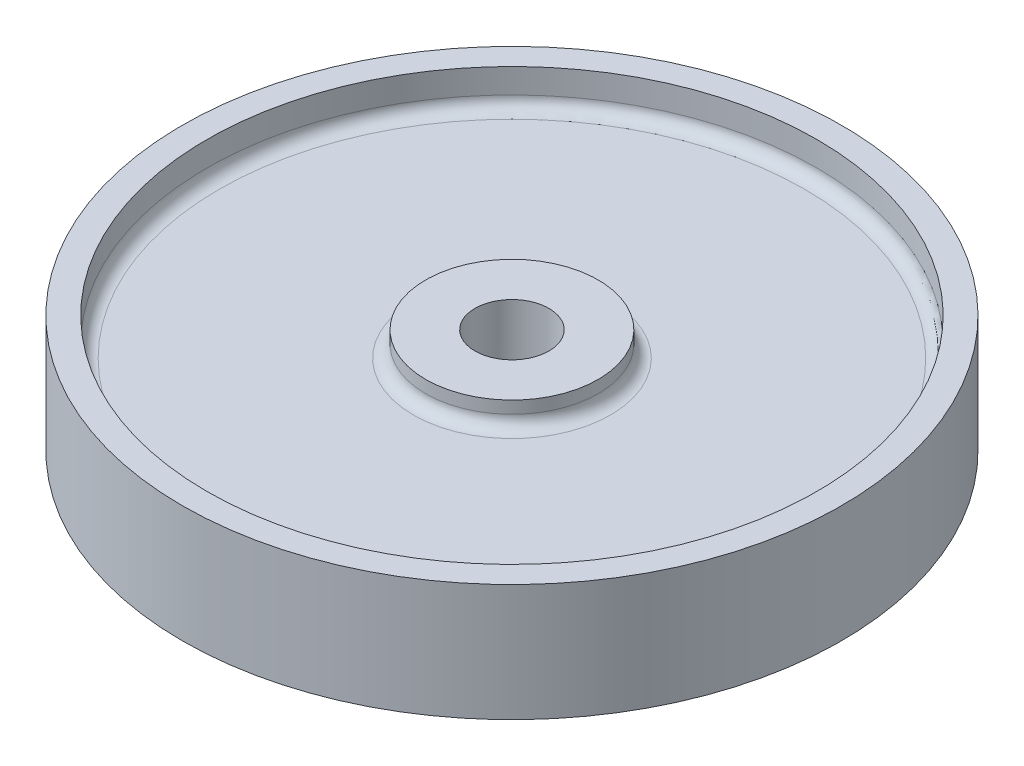
ISO-10303-21;
HEADER;
FILE_DESCRIPTION(('STEP AP214'),'2;1');
FILE_NAME('part.step','',(''),(''),'','','');
FILE_SCHEMA(('AUTOMOTIVE_DESIGN { 1 0 10303 214 1 1 1 1 }'));
ENDSEC;
DATA;
#1=APPLICATION_CONTEXT('core data for automotive mechanical design processes');
#2=APPLICATION_PROTOCOL_DEFINITION('international standard','automotive_design',2000,#1);
#3=PRODUCT_CONTEXT('',#1,'mechanical');
#4=PRODUCT('Part','Part','',(#3));
#5=PRODUCT_RELATED_PRODUCT_CATEGORY('part','',(#4));
#6=PRODUCT_DEFINITION_FORMATION('','',#4);
#7=PRODUCT_DEFINITION_CONTEXT('part definition',#1,'design');
#8=PRODUCT_DEFINITION('design','',#6,#7);
#9=PRODUCT_DEFINITION_SHAPE('','',#8);
#10=(LENGTH_UNIT() NAMED_UNIT(*) SI_UNIT(.MILLI.,.METRE.));
#11=(NAMED_UNIT(*) PLANE_ANGLE_UNIT() SI_UNIT($,.RADIAN.));
#12=(NAMED_UNIT(*) SI_UNIT($,.STERADIAN.) SOLID_ANGLE_UNIT());
#13=UNCERTAINTY_MEASURE_WITH_UNIT(LENGTH_MEASURE(1.E-05),#10,'distance_accuracy_value','');
#14=(GEOMETRIC_REPRESENTATION_CONTEXT(3) GLOBAL_UNCERTAINTY_ASSIGNED_CONTEXT((#13)) GLOBAL_UNIT_ASSIGNED_CONTEXT((#10,
#11,#12)) REPRESENTATION_CONTEXT('',''));
#15=CARTESIAN_POINT('',(0.,0.,0.));
#16=DIRECTION('',(0.,0.,1.));
#17=DIRECTION('',(1.,0.,0.));
#18=AXIS2_PLACEMENT_3D('',#15,#16,#17);
#19=CARTESIAN_POINT('',(0.,4.,0.));
#20=DIRECTION('',(0.,-1.,0.));
#21=DIRECTION('',(0.,0.,-1.));
#22=AXIS2_PLACEMENT_3D('',#19,#20,#21);
#23=TOROIDAL_SURFACE('',#22,16.,2.);
#24=CARTESIAN_POINT('',(0.,4.,0.));
#25=DIRECTION('',(0.,-1.,0.));
#26=DIRECTION('',(0.,0.,-1.));
#27=AXIS2_PLACEMENT_3D('',#24,#25,#26);
#28=CIRCLE('',#27,14.);
#29=CARTESIAN_POINT('',(0.,4.,-14.));
#30=VERTEX_POINT('',#29);
#31=EDGE_CURVE('E42',#30,#30,#28,.T.);
#32=ORIENTED_EDGE('',*,*,#31,.F.);
#33=EDGE_LOOP('',(#32));
#34=FACE_BOUND('',#33,.T.);
#35=CARTESIAN_POINT('',(0.,6.,0.));
#36=DIRECTION('',(0.,-1.,0.));
#37=DIRECTION('',(0.,0.,-1.));
#38=AXIS2_PLACEMENT_3D('',#35,#36,#37);
#39=CIRCLE('',#38,16.);
#40=CARTESIAN_POINT('',(0.,6.,-16.));
#41=VERTEX_POINT('',#40);
#42=EDGE_CURVE('E10',#41,#41,#39,.F.);
#43=ORIENTED_EDGE('',*,*,#42,.F.);
#44=EDGE_LOOP('',(#43));
#45=FACE_BOUND('',#44,.T.);
#46=ADVANCED_FACE('F35',(#34,#45),#23,.F.);
#47=CARTESIAN_POINT('',(0.,4.,0.));
#48=DIRECTION('',(0.,-1.,0.));
#49=DIRECTION('',(0.,0.,-1.));
#50=AXIS2_PLACEMENT_3D('',#47,#48,#49);
#51=TOROIDAL_SURFACE('',#50,47.5,2.);
#52=CARTESIAN_POINT('',(0.,4.,0.));
#53=DIRECTION('',(0.,-1.,0.));
#54=DIRECTION('',(0.,0.,-1.));
#55=AXIS2_PLACEMENT_3D('',#52,#53,#54);
#56=CIRCLE('',#55,49.5);
#57=CARTESIAN_POINT('',(0.,4.,-49.5));
#58=VERTEX_POINT('',#57);
#59=EDGE_CURVE('E51',#58,#58,#56,.F.);
#60=ORIENTED_EDGE('',*,*,#59,.F.);
#61=EDGE_LOOP('',(#60));
#62=FACE_BOUND('',#61,.T.);
#63=CARTESIAN_POINT('',(0.,6.,0.));
#64=DIRECTION('',(0.,-1.,0.));
#65=DIRECTION('',(0.,0.,-1.));
#66=AXIS2_PLACEMENT_3D('',#63,#64,#65);
#67=CIRCLE('',#66,47.5);
#68=CARTESIAN_POINT('',(0.,6.,-47.5));
#69=VERTEX_POINT('',#68);
#70=EDGE_CURVE('E46',#69,#69,#67,.T.);
#71=ORIENTED_EDGE('',*,*,#70,.F.);
#72=EDGE_LOOP('',(#71));
#73=FACE_BOUND('',#72,.T.);
#74=ADVANCED_FACE('F110',(#62,#73),#51,.F.);
#75=CARTESIAN_POINT('',(0.,0.,0.));
#76=DIRECTION('',(0.,1.,0.));
#77=DIRECTION('',(0.,0.,1.));
#78=AXIS2_PLACEMENT_3D('',#75,#76,#77);
#79=PLANE('',#78);
#80=CARTESIAN_POINT('',(0.,0.,0.));
#81=DIRECTION('',(0.,1.,0.));
#82=DIRECTION('',(0.,0.,1.));
#83=AXIS2_PLACEMENT_3D('',#80,#81,#82);
#84=CIRCLE('',#83,53.5);
#85=CARTESIAN_POINT('',(0.,0.,53.5));
#86=VERTEX_POINT('',#85);
#87=EDGE_CURVE('E67',#86,#86,#84,.T.);
#88=ORIENTED_EDGE('',*,*,#87,.F.);
#89=EDGE_LOOP('',(#88));
#90=FACE_BOUND('',#89,.T.);
#91=CARTESIAN_POINT('',(0.,0.,0.));
#92=DIRECTION('',(0.,1.,0.));
#93=DIRECTION('',(0.,0.,1.));
#94=AXIS2_PLACEMENT_3D('',#91,#92,#93);
#95=CIRCLE('',#94,49.5);
#96=CARTESIAN_POINT('',(0.,0.,49.5));
#97=VERTEX_POINT('',#96);
#98=EDGE_CURVE('E78',#97,#97,#95,.T.);
#99=ORIENTED_EDGE('',*,*,#98,.T.);
#100=EDGE_LOOP('',(#99));
#101=FACE_BOUND('',#100,.T.);
#102=ADVANCED_FACE('F115',(#90,#101),#79,.F.);
#103=CARTESIAN_POINT('',(0.,15.,0.));
#104=DIRECTION('',(0.,1.,0.));
#105=DIRECTION('',(0.,0.,1.));
#106=AXIS2_PLACEMENT_3D('',#103,#104,#105);
#107=TOROIDAL_SURFACE('',#106,16.,2.);
#108=CARTESIAN_POINT('',(0.,15.,0.));
#109=DIRECTION('',(0.,1.,0.));
#110=DIRECTION('',(0.,0.,1.));
#111=AXIS2_PLACEMENT_3D('',#108,#109,#110);
#112=CIRCLE('',#111,14.);
#113=CARTESIAN_POINT('',(0.,15.,14.));
#114=VERTEX_POINT('',#113);
#115=EDGE_CURVE('E57',#114,#114,#112,.T.);
#116=ORIENTED_EDGE('',*,*,#115,.F.);
#117=EDGE_LOOP('',(#116));
#118=FACE_BOUND('',#117,.T.);
#119=CARTESIAN_POINT('',(0.,13.,0.));
#120=DIRECTION('',(0.,1.,0.));
#121=DIRECTION('',(0.,0.,1.));
#122=AXIS2_PLACEMENT_3D('',#119,#120,#121);
#123=CIRCLE('',#122,16.);
#124=CARTESIAN_POINT('',(0.,13.,16.));
#125=VERTEX_POINT('',#124);
#126=EDGE_CURVE('E54',#125,#125,#123,.F.);
#127=ORIENTED_EDGE('',*,*,#126,.F.);
#128=EDGE_LOOP('',(#127));
#129=FACE_BOUND('',#128,.T.);
#130=ADVANCED_FACE('F122',(#118,#129),#107,.F.);
#131=CARTESIAN_POINT('',(0.,13.,0.));
#132=DIRECTION('',(0.,1.,0.));
#133=DIRECTION('',(0.,0.,1.));
#134=AXIS2_PLACEMENT_3D('',#131,#132,#133);
#135=PLANE('',#134);
#136=ORIENTED_EDGE('',*,*,#126,.T.);
#137=EDGE_LOOP('',(#136));
#138=FACE_BOUND('',#137,.T.);
#139=CARTESIAN_POINT('',(0.,13.,0.));
#140=DIRECTION('',(0.,1.,0.));
#141=DIRECTION('',(0.,0.,1.));
#142=AXIS2_PLACEMENT_3D('',#139,#140,#141);
#143=CIRCLE('',#142,47.5);
#144=CARTESIAN_POINT('',(0.,13.,47.5));
#145=VERTEX_POINT('',#144);
#146=EDGE_CURVE('E60',#145,#145,#143,.T.);
#147=ORIENTED_EDGE('',*,*,#146,.T.);
#148=EDGE_LOOP('',(#147));
#149=FACE_BOUND('',#148,.T.);
#150=ADVANCED_FACE('F130',(#138,#149),#135,.T.);
#151=CARTESIAN_POINT('',(0.,15.,0.));
#152=DIRECTION('',(0.,1.,0.));
#153=DIRECTION('',(0.,0.,1.));
#154=AXIS2_PLACEMENT_3D('',#151,#152,#153);
#155=TOROIDAL_SURFACE('',#154,47.5,2.);
#156=CARTESIAN_POINT('',(0.,15.,0.));
#157=DIRECTION('',(0.,1.,0.));
#158=DIRECTION('',(0.,0.,1.));
#159=AXIS2_PLACEMENT_3D('',#156,#157,#158);
#160=CIRCLE('',#159,49.5);
#161=CARTESIAN_POINT('',(0.,15.,49.5));
#162=VERTEX_POINT('',#161);
#163=EDGE_CURVE('E63',#162,#162,#160,.F.);
#164=ORIENTED_EDGE('',*,*,#163,.F.);
#165=EDGE_LOOP('',(#164));
#166=FACE_BOUND('',#165,.T.);
#167=ORIENTED_EDGE('',*,*,#146,.F.);
#168=EDGE_LOOP('',(#167));
#169=FACE_BOUND('',#168,.T.);
#170=ADVANCED_FACE('F132',(#166,#169),#155,.F.);
#171=CARTESIAN_POINT('',(0.,19.,0.));
#172=DIRECTION('',(0.,-1.,0.));
#173=DIRECTION('',(0.,0.,-1.));
#174=AXIS2_PLACEMENT_3D('',#171,#172,#173);
#175=CYLINDRICAL_SURFACE('',#174,53.5);
#176=CARTESIAN_POINT('',(0.,19.,0.));
#177=DIRECTION('',(0.,1.,0.));
#178=DIRECTION('',(0.,0.,1.));
#179=AXIS2_PLACEMENT_3D('',#176,#177,#178);
#180=CIRCLE('',#179,53.5);
#181=CARTESIAN_POINT('',(0.,19.,53.5));
#182=VERTEX_POINT('',#181);
#183=EDGE_CURVE('E66',#182,#182,#180,.T.);
#184=ORIENTED_EDGE('',*,*,#183,.F.);
#185=EDGE_LOOP('',(#184));
#186=FACE_BOUND('',#185,.T.);
#187=ORIENTED_EDGE('',*,*,#87,.T.);
#188=EDGE_LOOP('',(#187));
#189=FACE_BOUND('',#188,.T.);
#190=ADVANCED_FACE('F135',(#186,#189),#175,.T.);
#191=CARTESIAN_POINT('',(0.,19.,0.));
#192=DIRECTION('',(0.,1.,0.));
#193=DIRECTION('',(0.,0.,1.));
#194=AXIS2_PLACEMENT_3D('',#191,#192,#193);
#195=PLANE('',#194);
#196=CARTESIAN_POINT('',(0.,19.,0.));
#197=DIRECTION('',(0.,1.,0.));
#198=DIRECTION('',(0.,0.,1.));
#199=AXIS2_PLACEMENT_3D('',#196,#197,#198);
#200=CIRCLE('',#199,49.5);
#201=CARTESIAN_POINT('',(0.,19.,49.5));
#202=VERTEX_POINT('',#201);
#203=EDGE_CURVE('E70',#202,#202,#200,.T.);
#204=ORIENTED_EDGE('',*,*,#203,.F.);
#205=EDGE_LOOP('',(#204));
#206=FACE_BOUND('',#205,.T.);
#207=ORIENTED_EDGE('',*,*,#183,.T.);
#208=EDGE_LOOP('',(#207));
#209=FACE_BOUND('',#208,.T.);
#210=ADVANCED_FACE('F138',(#206,#209),#195,.T.);
#211=CARTESIAN_POINT('',(0.,13.,0.));
#212=DIRECTION('',(0.,1.,0.));
#213=DIRECTION('',(0.,0.,1.));
#214=AXIS2_PLACEMENT_3D('',#211,#212,#213);
#215=CYLINDRICAL_SURFACE('',#214,49.5);
#216=ORIENTED_EDGE('',*,*,#163,.T.);
#217=EDGE_LOOP('',(#216));
#218=FACE_BOUND('',#217,.T.);
#219=ORIENTED_EDGE('',*,*,#203,.T.);
#220=EDGE_LOOP('',(#219));
#221=FACE_BOUND('',#220,.T.);
#222=ADVANCED_FACE('F143',(#218,#221),#215,.F.);
#223=CARTESIAN_POINT('',(0.,17.,0.));
#224=DIRECTION('',(0.,-1.,0.));
#225=DIRECTION('',(0.,0.,-1.));
#226=AXIS2_PLACEMENT_3D('',#223,#224,#225);
#227=CYLINDRICAL_SURFACE('',#226,14.);
#228=ORIENTED_EDGE('',*,*,#115,.T.);
#229=EDGE_LOOP('',(#228));
#230=FACE_BOUND('',#229,.T.);
#231=CARTESIAN_POINT('',(0.,17.,0.));
#232=DIRECTION('',(0.,1.,0.));
#233=DIRECTION('',(0.,0.,1.));
#234=AXIS2_PLACEMENT_3D('',#231,#232,#233);
#235=CIRCLE('',#234,14.);
#236=CARTESIAN_POINT('',(0.,17.,14.));
#237=VERTEX_POINT('',#236);
#238=EDGE_CURVE('E75',#237,#237,#235,.T.);
#239=ORIENTED_EDGE('',*,*,#238,.F.);
#240=EDGE_LOOP('',(#239));
#241=FACE_BOUND('',#240,.T.);
#242=ADVANCED_FACE('F147',(#230,#241),#227,.T.);
#243=CARTESIAN_POINT('',(0.,17.,0.));
#244=DIRECTION('',(0.,1.,0.));
#245=DIRECTION('',(0.,0.,1.));
#246=AXIS2_PLACEMENT_3D('',#243,#244,#245);
#247=PLANE('',#246);
#248=CARTESIAN_POINT('',(0.,17.,0.));
#249=DIRECTION('',(0.,1.,0.));
#250=DIRECTION('',(0.,0.,1.));
#251=AXIS2_PLACEMENT_3D('',#248,#249,#250);
#252=CIRCLE('',#251,6.);
#253=CARTESIAN_POINT('',(0.,17.,6.));
#254=VERTEX_POINT('',#253);
#255=EDGE_CURVE('E84',#254,#254,#252,.T.);
#256=ORIENTED_EDGE('',*,*,#255,.F.);
#257=EDGE_LOOP('',(#256));
#258=FACE_BOUND('',#257,.T.);
#259=ORIENTED_EDGE('',*,*,#238,.T.);
#260=EDGE_LOOP('',(#259));
#261=FACE_BOUND('',#260,.T.);
#262=ADVANCED_FACE('F154',(#258,#261),#247,.T.);
#263=CARTESIAN_POINT('',(0.,6.,0.));
#264=DIRECTION('',(0.,-1.,0.));
#265=DIRECTION('',(0.,0.,-1.));
#266=AXIS2_PLACEMENT_3D('',#263,#264,#265);
#267=CYLINDRICAL_SURFACE('',#266,49.5);
#268=ORIENTED_EDGE('',*,*,#59,.T.);
#269=EDGE_LOOP('',(#268));
#270=FACE_BOUND('',#269,.T.);
#271=ORIENTED_EDGE('',*,*,#98,.F.);
#272=EDGE_LOOP('',(#271));
#273=FACE_BOUND('',#272,.T.);
#274=ADVANCED_FACE('F107',(#270,#273),#267,.F.);
#275=CARTESIAN_POINT('',(0.,6.,0.));
#276=DIRECTION('',(0.,-1.,0.));
#277=DIRECTION('',(0.,0.,1.));
#278=AXIS2_PLACEMENT_3D('',#275,#276,#277);
#279=PLANE('',#278);
#280=ORIENTED_EDGE('',*,*,#42,.T.);
#281=EDGE_LOOP('',(#280));
#282=FACE_BOUND('',#281,.T.);
#283=ORIENTED_EDGE('',*,*,#70,.T.);
#284=EDGE_LOOP('',(#283));
#285=FACE_BOUND('',#284,.T.);
#286=ADVANCED_FACE('F101',(#282,#285),#279,.T.);
#287=CARTESIAN_POINT('',(0.,2.,0.));
#288=DIRECTION('',(0.,1.,0.));
#289=DIRECTION('',(0.,0.,1.));
#290=AXIS2_PLACEMENT_3D('',#287,#288,#289);
#291=CYLINDRICAL_SURFACE('',#290,14.);
#292=ORIENTED_EDGE('',*,*,#31,.T.);
#293=EDGE_LOOP('',(#292));
#294=FACE_BOUND('',#293,.T.);
#295=CARTESIAN_POINT('',(0.,2.,0.));
#296=DIRECTION('',(0.,1.,0.));
#297=DIRECTION('',(0.,0.,1.));
#298=AXIS2_PLACEMENT_3D('',#295,#296,#297);
#299=CIRCLE('',#298,14.);
#300=CARTESIAN_POINT('',(0.,2.,14.));
#301=VERTEX_POINT('',#300);
#302=EDGE_CURVE('E81',#301,#301,#299,.T.);
#303=ORIENTED_EDGE('',*,*,#302,.T.);
#304=EDGE_LOOP('',(#303));
#305=FACE_BOUND('',#304,.T.);
#306=ADVANCED_FACE('F96',(#294,#305),#291,.T.);
#307=CARTESIAN_POINT('',(0.,2.,0.));
#308=DIRECTION('',(0.,-1.,0.));
#309=DIRECTION('',(0.,0.,1.));
#310=AXIS2_PLACEMENT_3D('',#307,#308,#309);
#311=PLANE('',#310);
#312=CARTESIAN_POINT('',(0.,2.,0.));
#313=DIRECTION('',(0.,-1.,0.));
#314=DIRECTION('',(0.,0.,-1.));
#315=AXIS2_PLACEMENT_3D('',#312,#313,#314);
#316=CIRCLE('',#315,6.);
#317=CARTESIAN_POINT('',(0.,2.,-6.));
#318=VERTEX_POINT('',#317);
#319=EDGE_CURVE('E38',#318,#318,#316,.T.);
#320=ORIENTED_EDGE('',*,*,#319,.F.);
#321=EDGE_LOOP('',(#320));
#322=FACE_BOUND('',#321,.T.);
#323=ORIENTED_EDGE('',*,*,#302,.F.);
#324=EDGE_LOOP('',(#323));
#325=FACE_BOUND('',#324,.T.);
#326=ADVANCED_FACE('F93',(#322,#325),#311,.T.);
#327=CARTESIAN_POINT('',(0.,0.,0.));
#328=DIRECTION('',(0.,1.,0.));
#329=DIRECTION('',(0.,0.,1.));
#330=AXIS2_PLACEMENT_3D('',#327,#328,#329);
#331=CYLINDRICAL_SURFACE('',#330,6.);
#332=ORIENTED_EDGE('',*,*,#319,.T.);
#333=EDGE_LOOP('',(#332));
#334=FACE_BOUND('',#333,.T.);
#335=ORIENTED_EDGE('',*,*,#255,.T.);
#336=EDGE_LOOP('',(#335));
#337=FACE_BOUND('',#336,.T.);
#338=ADVANCED_FACE('F91',(#334,#337),#331,.F.);
#339=CLOSED_SHELL('',(#46,#74,#102,#130,#150,#170,#190,#210,#222,#242,#262,#274,#286,#306,#326,#338));
#340=MANIFOLD_SOLID_BREP('B2',#339);
#341=ADVANCED_BREP_SHAPE_REPRESENTATION('',(#18,#340),#14);
#342=SHAPE_DEFINITION_REPRESENTATION(#9,#341);
ENDSEC;
END-ISO-10303-21;
